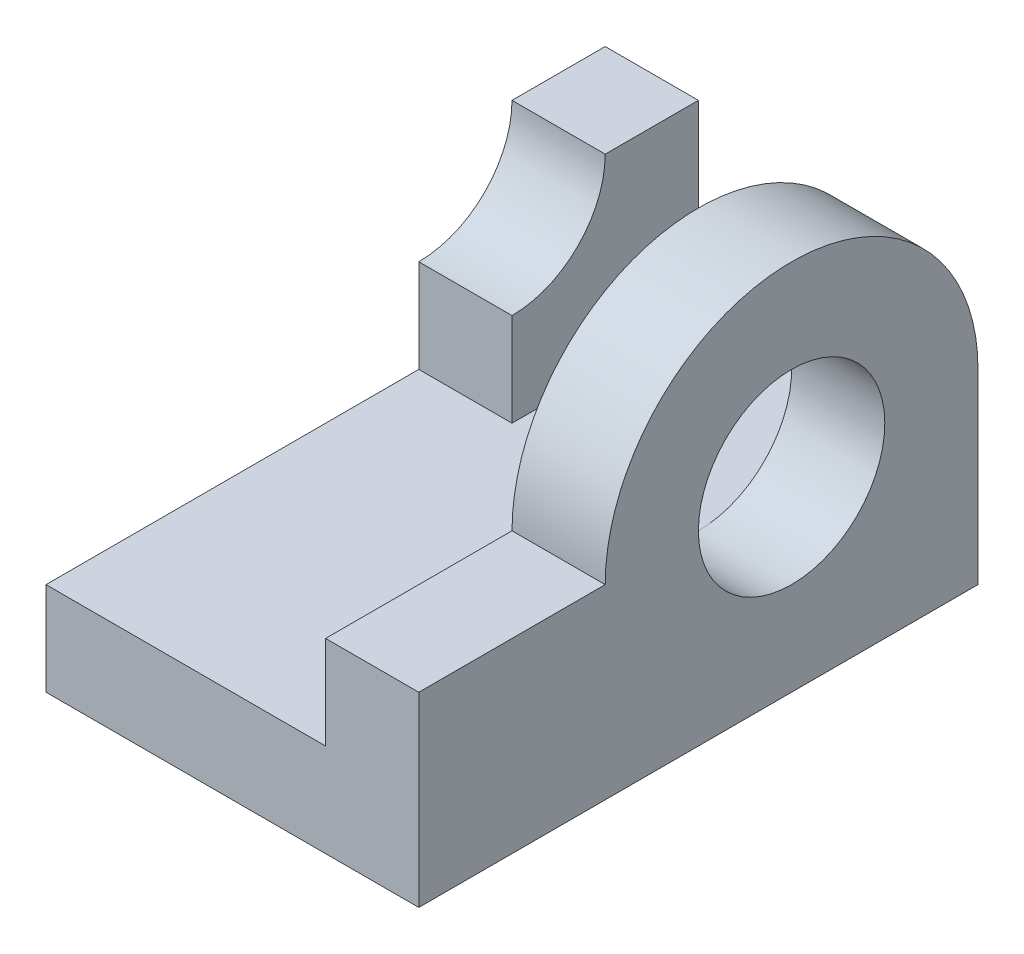
ISO-10303-21;
HEADER;
FILE_DESCRIPTION(('STEP AP214'),'2;1');
FILE_NAME('part.step','',(''),(''),'','','');
FILE_SCHEMA(('AUTOMOTIVE_DESIGN { 1 0 10303 214 1 1 1 1 }'));
ENDSEC;
DATA;
#1=APPLICATION_CONTEXT('core data for automotive mechanical design processes');
#2=APPLICATION_PROTOCOL_DEFINITION('international standard','automotive_design',2000,#1);
#3=PRODUCT_CONTEXT('',#1,'mechanical');
#4=PRODUCT('Part','Part','',(#3));
#5=PRODUCT_RELATED_PRODUCT_CATEGORY('part','',(#4));
#6=PRODUCT_DEFINITION_FORMATION('','',#4);
#7=PRODUCT_DEFINITION_CONTEXT('part definition',#1,'design');
#8=PRODUCT_DEFINITION('design','',#6,#7);
#9=PRODUCT_DEFINITION_SHAPE('','',#8);
#10=(LENGTH_UNIT() NAMED_UNIT(*) SI_UNIT(.MILLI.,.METRE.));
#11=(NAMED_UNIT(*) PLANE_ANGLE_UNIT() SI_UNIT($,.RADIAN.));
#12=(NAMED_UNIT(*) SI_UNIT($,.STERADIAN.) SOLID_ANGLE_UNIT());
#13=UNCERTAINTY_MEASURE_WITH_UNIT(LENGTH_MEASURE(1.E-05),#10,'distance_accuracy_value','');
#14=(GEOMETRIC_REPRESENTATION_CONTEXT(3) GLOBAL_UNCERTAINTY_ASSIGNED_CONTEXT((#13)) GLOBAL_UNIT_ASSIGNED_CONTEXT((#10,
#11,#12)) REPRESENTATION_CONTEXT('',''));
#15=CARTESIAN_POINT('',(0.,0.,0.));
#16=DIRECTION('',(0.,0.,1.));
#17=DIRECTION('',(1.,0.,0.));
#18=AXIS2_PLACEMENT_3D('',#15,#16,#17);
#19=CARTESIAN_POINT('',(0.,0.,0.));
#20=DIRECTION('',(1.,0.,0.));
#21=DIRECTION('',(0.,0.,-1.));
#22=AXIS2_PLACEMENT_3D('',#19,#20,#21);
#23=PLANE('',#22);
#24=CARTESIAN_POINT('',(0.,0.,0.));
#25=DIRECTION('',(1.,0.,0.));
#26=DIRECTION('',(0.,0.,-1.));
#27=AXIS2_PLACEMENT_3D('',#24,#25,#26);
#28=CIRCLE('',#27,20.);
#29=CARTESIAN_POINT('',(0.,0.,-20.));
#30=VERTEX_POINT('',#29);
#31=CARTESIAN_POINT('',(0.,0.,20.));
#32=VERTEX_POINT('',#31);
#33=EDGE_CURVE('E242',#30,#32,#28,.T.);
#34=ORIENTED_EDGE('',*,*,#33,.F.);
#35=DIRECTION('',(0.,1.,0.));
#36=VECTOR('',#35,1.);
#37=CARTESIAN_POINT('',(0.,-20.,-20.));
#38=LINE('',#37,#36);
#39=CARTESIAN_POINT('',(0.,-10.,-20.));
#40=VERTEX_POINT('',#39);
#41=EDGE_CURVE('E187',#40,#30,#38,.T.);
#42=ORIENTED_EDGE('',*,*,#41,.F.);
#43=DIRECTION('',(0.,0.,-1.));
#44=VECTOR('',#43,1.);
#45=CARTESIAN_POINT('',(0.,-10.,0.));
#46=LINE('',#45,#44);
#47=CARTESIAN_POINT('',(0.,-10.,0.));
#48=VERTEX_POINT('',#47);
#49=EDGE_CURVE('E11',#48,#40,#46,.T.);
#50=ORIENTED_EDGE('',*,*,#49,.F.);
#51=CARTESIAN_POINT('',(0.,0.,0.));
#52=DIRECTION('',(1.,0.,0.));
#53=DIRECTION('',(0.,0.,-1.));
#54=AXIS2_PLACEMENT_3D('',#51,#52,#53);
#55=CIRCLE('',#54,10.);
#56=EDGE_CURVE('E221',#48,#48,#55,.T.);
#57=ORIENTED_EDGE('',*,*,#56,.T.);
#58=CARTESIAN_POINT('',(0.,-10.,40.));
#59=VERTEX_POINT('',#58);
#60=EDGE_CURVE('E52',#59,#48,#46,.T.);
#61=ORIENTED_EDGE('',*,*,#60,.F.);
#62=DIRECTION('',(0.,-1.,0.));
#63=VECTOR('',#62,1.);
#64=CARTESIAN_POINT('',(0.,0.,40.));
#65=LINE('',#64,#63);
#66=CARTESIAN_POINT('',(0.,0.,40.));
#67=VERTEX_POINT('',#66);
#68=EDGE_CURVE('E226',#67,#59,#65,.T.);
#69=ORIENTED_EDGE('',*,*,#68,.F.);
#70=DIRECTION('',(0.,0.,1.));
#71=VECTOR('',#70,1.);
#72=CARTESIAN_POINT('',(0.,0.,0.));
#73=LINE('',#72,#71);
#74=EDGE_CURVE('E245',#32,#67,#73,.T.);
#75=ORIENTED_EDGE('',*,*,#74,.F.);
#76=EDGE_LOOP('',(#34,#42,#50,#57,#61,#69,#75));
#77=FACE_BOUND('',#76,.T.);
#78=ADVANCED_FACE('F41',(#77),#23,.F.);
#79=CARTESIAN_POINT('',(10.,0.,0.));
#80=DIRECTION('',(-1.,0.,0.));
#81=DIRECTION('',(0.,0.,1.));
#82=AXIS2_PLACEMENT_3D('',#79,#80,#81);
#83=CYLINDRICAL_SURFACE('',#82,20.);
#84=CARTESIAN_POINT('',(10.,0.,0.));
#85=DIRECTION('',(1.,0.,0.));
#86=DIRECTION('',(0.,0.,-1.));
#87=AXIS2_PLACEMENT_3D('',#84,#85,#86);
#88=CIRCLE('',#87,20.);
#89=CARTESIAN_POINT('',(10.,0.,-20.));
#90=VERTEX_POINT('',#89);
#91=CARTESIAN_POINT('',(10.,0.,20.));
#92=VERTEX_POINT('',#91);
#93=EDGE_CURVE('E64',#90,#92,#88,.T.);
#94=ORIENTED_EDGE('',*,*,#93,.F.);
#95=DIRECTION('',(1.,0.,0.));
#96=VECTOR('',#95,1.);
#97=CARTESIAN_POINT('',(0.,0.,-20.));
#98=LINE('',#97,#96);
#99=EDGE_CURVE('E59',#30,#90,#98,.T.);
#100=ORIENTED_EDGE('',*,*,#99,.F.);
#101=ORIENTED_EDGE('',*,*,#33,.T.);
#102=DIRECTION('',(-1.,0.,0.));
#103=VECTOR('',#102,1.);
#104=CARTESIAN_POINT('',(10.,0.,20.));
#105=LINE('',#104,#103);
#106=EDGE_CURVE('E45',#92,#32,#105,.T.);
#107=ORIENTED_EDGE('',*,*,#106,.F.);
#108=EDGE_LOOP('',(#94,#100,#101,#107));
#109=FACE_BOUND('',#108,.T.);
#110=ADVANCED_FACE('F265',(#109),#83,.T.);
#111=CARTESIAN_POINT('',(10.,0.,0.));
#112=DIRECTION('',(0.,-1.,0.));
#113=DIRECTION('',(0.,0.,-1.));
#114=AXIS2_PLACEMENT_3D('',#111,#112,#113);
#115=PLANE('',#114);
#116=ORIENTED_EDGE('',*,*,#74,.T.);
#117=DIRECTION('',(-1.,0.,0.));
#118=VECTOR('',#117,1.);
#119=CARTESIAN_POINT('',(10.,0.,40.));
#120=LINE('',#119,#118);
#121=CARTESIAN_POINT('',(10.,0.,40.));
#122=VERTEX_POINT('',#121);
#123=EDGE_CURVE('E252',#122,#67,#120,.T.);
#124=ORIENTED_EDGE('',*,*,#123,.F.);
#125=DIRECTION('',(0.,0.,1.));
#126=VECTOR('',#125,1.);
#127=CARTESIAN_POINT('',(10.,0.,0.));
#128=LINE('',#127,#126);
#129=EDGE_CURVE('E229',#92,#122,#128,.T.);
#130=ORIENTED_EDGE('',*,*,#129,.F.);
#131=ORIENTED_EDGE('',*,*,#106,.T.);
#132=EDGE_LOOP('',(#116,#124,#130,#131));
#133=FACE_BOUND('',#132,.T.);
#134=ADVANCED_FACE('F263',(#133),#115,.F.);
#135=CARTESIAN_POINT('',(10.,0.,40.));
#136=DIRECTION('',(0.,0.,-1.));
#137=DIRECTION('',(-1.,0.,0.));
#138=AXIS2_PLACEMENT_3D('',#135,#136,#137);
#139=PLANE('',#138);
#140=ORIENTED_EDGE('',*,*,#68,.T.);
#141=DIRECTION('',(1.,0.,0.));
#142=VECTOR('',#141,1.);
#143=CARTESIAN_POINT('',(-30.,-10.,40.));
#144=LINE('',#143,#142);
#145=CARTESIAN_POINT('',(-30.,-10.,40.));
#146=VERTEX_POINT('',#145);
#147=EDGE_CURVE('E213',#146,#59,#144,.T.);
#148=ORIENTED_EDGE('',*,*,#147,.F.);
#149=DIRECTION('',(0.,1.,0.));
#150=VECTOR('',#149,1.);
#151=CARTESIAN_POINT('',(-30.,0.,40.));
#152=LINE('',#151,#150);
#153=CARTESIAN_POINT('',(-30.,-20.,40.));
#154=VERTEX_POINT('',#153);
#155=EDGE_CURVE('E203',#154,#146,#152,.T.);
#156=ORIENTED_EDGE('',*,*,#155,.F.);
#157=DIRECTION('',(-1.,0.,0.));
#158=VECTOR('',#157,1.);
#159=CARTESIAN_POINT('',(10.,-20.,40.));
#160=LINE('',#159,#158);
#161=CARTESIAN_POINT('',(10.,-20.,40.));
#162=VERTEX_POINT('',#161);
#163=EDGE_CURVE('E238',#162,#154,#160,.T.);
#164=ORIENTED_EDGE('',*,*,#163,.F.);
#165=DIRECTION('',(0.,-1.,0.));
#166=VECTOR('',#165,1.);
#167=CARTESIAN_POINT('',(10.,0.,40.));
#168=LINE('',#167,#166);
#169=EDGE_CURVE('E232',#122,#162,#168,.T.);
#170=ORIENTED_EDGE('',*,*,#169,.F.);
#171=ORIENTED_EDGE('',*,*,#123,.T.);
#172=EDGE_LOOP('',(#140,#148,#156,#164,#170,#171));
#173=FACE_BOUND('',#172,.T.);
#174=ADVANCED_FACE('F269',(#173),#139,.F.);
#175=CARTESIAN_POINT('',(10.,0.,0.));
#176=DIRECTION('',(-1.,0.,0.));
#177=DIRECTION('',(0.,0.,1.));
#178=AXIS2_PLACEMENT_3D('',#175,#176,#177);
#179=CYLINDRICAL_SURFACE('',#178,10.);
#180=CARTESIAN_POINT('',(10.,0.,0.));
#181=DIRECTION('',(1.,0.,0.));
#182=DIRECTION('',(0.,0.,-1.));
#183=AXIS2_PLACEMENT_3D('',#180,#181,#182);
#184=CIRCLE('',#183,10.);
#185=CARTESIAN_POINT('',(10.,0.,-10.));
#186=VERTEX_POINT('',#185);
#187=EDGE_CURVE('E222',#186,#186,#184,.T.);
#188=ORIENTED_EDGE('',*,*,#187,.T.);
#189=EDGE_LOOP('',(#188));
#190=FACE_BOUND('',#189,.T.);
#191=ORIENTED_EDGE('',*,*,#56,.F.);
#192=EDGE_LOOP('',(#191));
#193=FACE_BOUND('',#192,.T.);
#194=ADVANCED_FACE('F43',(#190,#193),#179,.F.);
#195=CARTESIAN_POINT('',(10.,-20.,0.));
#196=DIRECTION('',(0.,1.,0.));
#197=DIRECTION('',(0.,0.,1.));
#198=AXIS2_PLACEMENT_3D('',#195,#196,#197);
#199=PLANE('',#198);
#200=ORIENTED_EDGE('',*,*,#163,.T.);
#201=DIRECTION('',(0.,0.,-1.));
#202=VECTOR('',#201,1.);
#203=CARTESIAN_POINT('',(-30.,-20.,0.));
#204=LINE('',#203,#202);
#205=CARTESIAN_POINT('',(-30.,-20.,-20.));
#206=VERTEX_POINT('',#205);
#207=EDGE_CURVE('E199',#154,#206,#204,.T.);
#208=ORIENTED_EDGE('',*,*,#207,.T.);
#209=DIRECTION('',(1.,0.,0.));
#210=VECTOR('',#209,1.);
#211=CARTESIAN_POINT('',(-30.,-20.,-20.));
#212=LINE('',#211,#210);
#213=CARTESIAN_POINT('',(10.,-20.,-20.));
#214=VERTEX_POINT('',#213);
#215=EDGE_CURVE('E217',#206,#214,#212,.T.);
#216=ORIENTED_EDGE('',*,*,#215,.T.);
#217=DIRECTION('',(0.,0.,-1.));
#218=VECTOR('',#217,1.);
#219=CARTESIAN_POINT('',(10.,-20.,0.));
#220=LINE('',#219,#218);
#221=EDGE_CURVE('E235',#162,#214,#220,.T.);
#222=ORIENTED_EDGE('',*,*,#221,.F.);
#223=EDGE_LOOP('',(#200,#208,#216,#222));
#224=FACE_BOUND('',#223,.T.);
#225=ADVANCED_FACE('F278',(#224),#199,.F.);
#226=CARTESIAN_POINT('',(10.,0.,0.));
#227=DIRECTION('',(1.,0.,0.));
#228=DIRECTION('',(0.,0.,-1.));
#229=AXIS2_PLACEMENT_3D('',#226,#227,#228);
#230=PLANE('',#229);
#231=ORIENTED_EDGE('',*,*,#221,.T.);
#232=DIRECTION('',(0.,1.,0.));
#233=VECTOR('',#232,1.);
#234=CARTESIAN_POINT('',(10.,-20.,-20.));
#235=LINE('',#234,#233);
#236=EDGE_CURVE('E181',#214,#90,#235,.T.);
#237=ORIENTED_EDGE('',*,*,#236,.T.);
#238=ORIENTED_EDGE('',*,*,#93,.T.);
#239=ORIENTED_EDGE('',*,*,#129,.T.);
#240=ORIENTED_EDGE('',*,*,#169,.T.);
#241=EDGE_LOOP('',(#231,#237,#238,#239,#240));
#242=FACE_BOUND('',#241,.T.);
#243=ORIENTED_EDGE('',*,*,#187,.F.);
#244=EDGE_LOOP('',(#243));
#245=FACE_BOUND('',#244,.T.);
#246=ADVANCED_FACE('F281',(#242,#245),#230,.T.);
#247=CARTESIAN_POINT('',(-30.,0.,-20.));
#248=DIRECTION('',(0.,0.,-1.));
#249=DIRECTION('',(-1.,0.,0.));
#250=AXIS2_PLACEMENT_3D('',#247,#248,#249);
#251=PLANE('',#250);
#252=DIRECTION('',(0.,1.,0.));
#253=VECTOR('',#252,1.);
#254=CARTESIAN_POINT('',(-30.,0.,-20.));
#255=LINE('',#254,#253);
#256=CARTESIAN_POINT('',(-30.,9.99999999999999,-20.));
#257=VERTEX_POINT('',#256);
#258=EDGE_CURVE('E196',#206,#257,#255,.T.);
#259=ORIENTED_EDGE('',*,*,#258,.T.);
#260=DIRECTION('',(-1.,0.,0.));
#261=VECTOR('',#260,1.);
#262=CARTESIAN_POINT('',(-20.,9.99999999999999,-20.));
#263=LINE('',#262,#261);
#264=CARTESIAN_POINT('',(-20.,9.99999999999999,-20.));
#265=VERTEX_POINT('',#264);
#266=EDGE_CURVE('E177',#265,#257,#263,.T.);
#267=ORIENTED_EDGE('',*,*,#266,.F.);
#268=DIRECTION('',(0.,-1.,0.));
#269=VECTOR('',#268,1.);
#270=CARTESIAN_POINT('',(-20.,-10.,-20.));
#271=LINE('',#270,#269);
#272=CARTESIAN_POINT('',(-20.,-10.,-20.));
#273=VERTEX_POINT('',#272);
#274=EDGE_CURVE('E140',#265,#273,#271,.T.);
#275=ORIENTED_EDGE('',*,*,#274,.T.);
#276=DIRECTION('',(1.,0.,0.));
#277=VECTOR('',#276,1.);
#278=CARTESIAN_POINT('',(-30.,-10.,-20.));
#279=LINE('',#278,#277);
#280=EDGE_CURVE('E155',#273,#40,#279,.T.);
#281=ORIENTED_EDGE('',*,*,#280,.T.);
#282=ORIENTED_EDGE('',*,*,#41,.T.);
#283=ORIENTED_EDGE('',*,*,#99,.T.);
#284=ORIENTED_EDGE('',*,*,#236,.F.);
#285=ORIENTED_EDGE('',*,*,#215,.F.);
#286=EDGE_LOOP('',(#259,#267,#275,#281,#282,#283,#284,#285));
#287=FACE_BOUND('',#286,.T.);
#288=ADVANCED_FACE('F284',(#287),#251,.T.);
#289=CARTESIAN_POINT('',(-30.,-10.,0.));
#290=DIRECTION('',(0.,-1.,0.));
#291=DIRECTION('',(0.,0.,-1.));
#292=AXIS2_PLACEMENT_3D('',#289,#290,#291);
#293=PLANE('',#292);
#294=DIRECTION('',(0.,0.,1.));
#295=VECTOR('',#294,1.);
#296=CARTESIAN_POINT('',(-20.,-10.,0.));
#297=LINE('',#296,#295);
#298=CARTESIAN_POINT('',(-20.,-10.,0.));
#299=VERTEX_POINT('',#298);
#300=EDGE_CURVE('E146',#273,#299,#297,.T.);
#301=ORIENTED_EDGE('',*,*,#300,.T.);
#302=DIRECTION('',(-1.,0.,0.));
#303=VECTOR('',#302,1.);
#304=CARTESIAN_POINT('',(-20.,-10.,0.));
#305=LINE('',#304,#303);
#306=CARTESIAN_POINT('',(-30.,-10.,0.));
#307=VERTEX_POINT('',#306);
#308=EDGE_CURVE('E128',#299,#307,#305,.T.);
#309=ORIENTED_EDGE('',*,*,#308,.T.);
#310=DIRECTION('',(0.,0.,-1.));
#311=VECTOR('',#310,1.);
#312=CARTESIAN_POINT('',(-30.,-10.,0.));
#313=LINE('',#312,#311);
#314=EDGE_CURVE('E206',#146,#307,#313,.T.);
#315=ORIENTED_EDGE('',*,*,#314,.F.);
#316=ORIENTED_EDGE('',*,*,#147,.T.);
#317=ORIENTED_EDGE('',*,*,#60,.T.);
#318=ORIENTED_EDGE('',*,*,#49,.T.);
#319=ORIENTED_EDGE('',*,*,#280,.F.);
#320=EDGE_LOOP('',(#301,#309,#315,#316,#317,#318,#319));
#321=FACE_BOUND('',#320,.T.);
#322=ADVANCED_FACE('F154',(#321),#293,.F.);
#323=CARTESIAN_POINT('',(-30.,0.,0.));
#324=DIRECTION('',(-1.,0.,0.));
#325=DIRECTION('',(0.,0.,1.));
#326=AXIS2_PLACEMENT_3D('',#323,#324,#325);
#327=PLANE('',#326);
#328=ORIENTED_EDGE('',*,*,#258,.F.);
#329=ORIENTED_EDGE('',*,*,#207,.F.);
#330=ORIENTED_EDGE('',*,*,#155,.T.);
#331=ORIENTED_EDGE('',*,*,#314,.T.);
#332=DIRECTION('',(0.,1.,0.));
#333=VECTOR('',#332,1.);
#334=CARTESIAN_POINT('',(-30.,0.,0.));
#335=LINE('',#334,#333);
#336=CARTESIAN_POINT('',(-30.,0.,0.));
#337=VERTEX_POINT('',#336);
#338=EDGE_CURVE('E133',#307,#337,#335,.T.);
#339=ORIENTED_EDGE('',*,*,#338,.T.);
#340=CARTESIAN_POINT('',(-30.,9.99999999999999,0.));
#341=DIRECTION('',(1.,0.,0.));
#342=DIRECTION('',(0.,0.,-1.));
#343=AXIS2_PLACEMENT_3D('',#340,#341,#342);
#344=CIRCLE('',#343,9.99999999999999);
#345=CARTESIAN_POINT('',(-30.,9.99999999999999,-10.));
#346=VERTEX_POINT('',#345);
#347=EDGE_CURVE('E161',#337,#346,#344,.T.);
#348=ORIENTED_EDGE('',*,*,#347,.T.);
#349=DIRECTION('',(0.,0.,-1.));
#350=VECTOR('',#349,1.);
#351=CARTESIAN_POINT('',(-30.,9.99999999999999,-20.));
#352=LINE('',#351,#350);
#353=EDGE_CURVE('E157',#346,#257,#352,.T.);
#354=ORIENTED_EDGE('',*,*,#353,.T.);
#355=EDGE_LOOP('',(#328,#329,#330,#331,#339,#348,#354));
#356=FACE_BOUND('',#355,.T.);
#357=ADVANCED_FACE('F273',(#356),#327,.T.);
#358=CARTESIAN_POINT('',(-20.,9.99999999999999,-20.));
#359=DIRECTION('',(0.,1.,0.));
#360=DIRECTION('',(0.,0.,1.));
#361=AXIS2_PLACEMENT_3D('',#358,#359,#360);
#362=PLANE('',#361);
#363=ORIENTED_EDGE('',*,*,#353,.F.);
#364=DIRECTION('',(-1.,0.,0.));
#365=VECTOR('',#364,1.);
#366=CARTESIAN_POINT('',(-20.,9.99999999999999,-10.));
#367=LINE('',#366,#365);
#368=CARTESIAN_POINT('',(-20.,9.99999999999999,-10.));
#369=VERTEX_POINT('',#368);
#370=EDGE_CURVE('E182',#369,#346,#367,.T.);
#371=ORIENTED_EDGE('',*,*,#370,.F.);
#372=DIRECTION('',(0.,0.,-1.));
#373=VECTOR('',#372,1.);
#374=CARTESIAN_POINT('',(-20.,9.99999999999999,-20.));
#375=LINE('',#374,#373);
#376=EDGE_CURVE('E166',#369,#265,#375,.T.);
#377=ORIENTED_EDGE('',*,*,#376,.T.);
#378=ORIENTED_EDGE('',*,*,#266,.T.);
#379=EDGE_LOOP('',(#363,#371,#377,#378));
#380=FACE_BOUND('',#379,.T.);
#381=ADVANCED_FACE('F372',(#380),#362,.T.);
#382=CARTESIAN_POINT('',(-20.,9.99999999999999,0.));
#383=DIRECTION('',(-1.,0.,0.));
#384=DIRECTION('',(0.,0.,1.));
#385=AXIS2_PLACEMENT_3D('',#382,#383,#384);
#386=CYLINDRICAL_SURFACE('',#385,9.99999999999999);
#387=ORIENTED_EDGE('',*,*,#347,.F.);
#388=DIRECTION('',(-1.,0.,0.));
#389=VECTOR('',#388,1.);
#390=CARTESIAN_POINT('',(-20.,0.,0.));
#391=LINE('',#390,#389);
#392=CARTESIAN_POINT('',(-20.,0.,0.));
#393=VERTEX_POINT('',#392);
#394=EDGE_CURVE('E139',#393,#337,#391,.T.);
#395=ORIENTED_EDGE('',*,*,#394,.F.);
#396=CARTESIAN_POINT('',(-20.,9.99999999999999,0.));
#397=DIRECTION('',(1.,0.,0.));
#398=DIRECTION('',(0.,0.,-1.));
#399=AXIS2_PLACEMENT_3D('',#396,#397,#398);
#400=CIRCLE('',#399,9.99999999999999);
#401=EDGE_CURVE('E150',#393,#369,#400,.T.);
#402=ORIENTED_EDGE('',*,*,#401,.T.);
#403=ORIENTED_EDGE('',*,*,#370,.T.);
#404=EDGE_LOOP('',(#387,#395,#402,#403));
#405=FACE_BOUND('',#404,.T.);
#406=ADVANCED_FACE('F381',(#405),#386,.F.);
#407=CARTESIAN_POINT('',(-20.,0.,0.));
#408=DIRECTION('',(0.,0.,1.));
#409=DIRECTION('',(1.,0.,0.));
#410=AXIS2_PLACEMENT_3D('',#407,#408,#409);
#411=PLANE('',#410);
#412=ORIENTED_EDGE('',*,*,#338,.F.);
#413=ORIENTED_EDGE('',*,*,#308,.F.);
#414=DIRECTION('',(0.,1.,0.));
#415=VECTOR('',#414,1.);
#416=CARTESIAN_POINT('',(-20.,0.,0.));
#417=LINE('',#416,#415);
#418=EDGE_CURVE('E131',#299,#393,#417,.T.);
#419=ORIENTED_EDGE('',*,*,#418,.T.);
#420=ORIENTED_EDGE('',*,*,#394,.T.);
#421=EDGE_LOOP('',(#412,#413,#419,#420));
#422=FACE_BOUND('',#421,.T.);
#423=ADVANCED_FACE('F130',(#422),#411,.T.);
#424=CARTESIAN_POINT('',(-20.,9.99999999999999,0.));
#425=DIRECTION('',(1.,0.,0.));
#426=DIRECTION('',(0.,0.,-1.));
#427=AXIS2_PLACEMENT_3D('',#424,#425,#426);
#428=PLANE('',#427);
#429=ORIENTED_EDGE('',*,*,#300,.F.);
#430=ORIENTED_EDGE('',*,*,#274,.F.);
#431=ORIENTED_EDGE('',*,*,#376,.F.);
#432=ORIENTED_EDGE('',*,*,#401,.F.);
#433=ORIENTED_EDGE('',*,*,#418,.F.);
#434=EDGE_LOOP('',(#429,#430,#431,#432,#433));
#435=FACE_BOUND('',#434,.T.);
#436=ADVANCED_FACE('F144',(#435),#428,.T.);
#437=CLOSED_SHELL('',(#78,#110,#134,#174,#194,#225,#246,#288,#322,#357,#381,#406,#423,#436));
#438=MANIFOLD_SOLID_BREP('B2',#437);
#439=ADVANCED_BREP_SHAPE_REPRESENTATION('',(#18,#438),#14);
#440=SHAPE_DEFINITION_REPRESENTATION(#9,#439);
ENDSEC;
END-ISO-10303-21;
